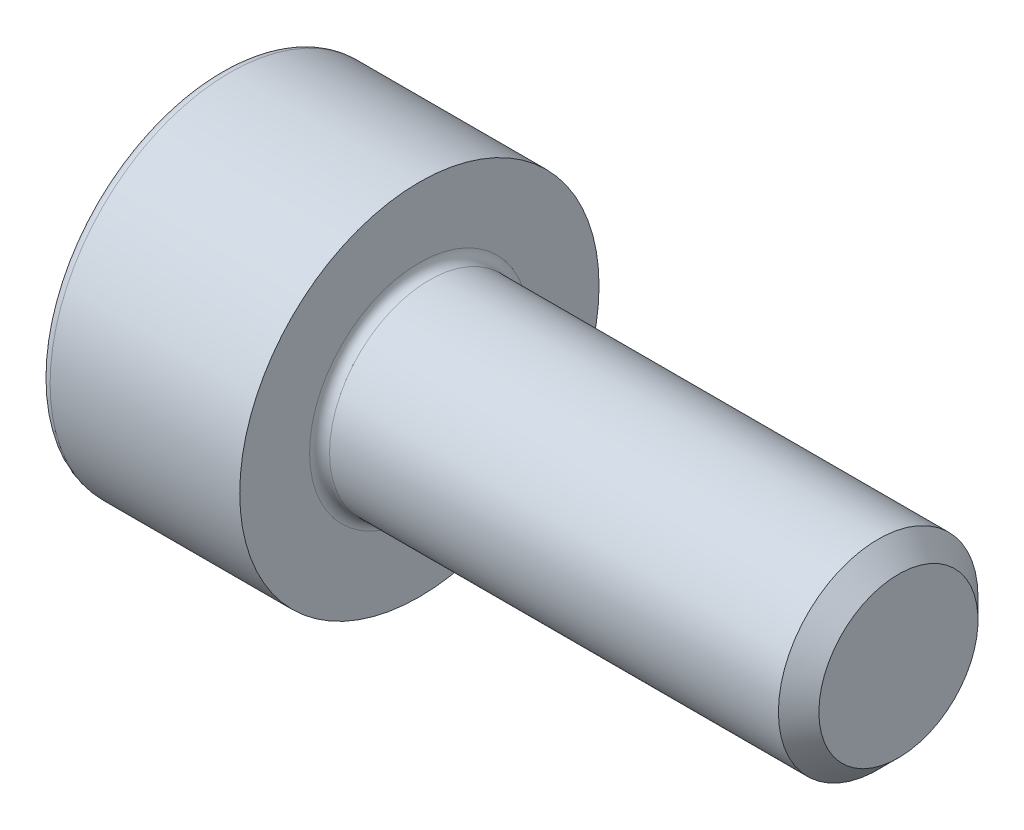
ISO-10303-21;
HEADER;
FILE_DESCRIPTION(('STEP AP214'),'2;1');
FILE_NAME('part.step','',(''),(''),'','','');
FILE_SCHEMA(('AUTOMOTIVE_DESIGN { 1 0 10303 214 1 1 1 1 }'));
ENDSEC;
DATA;
#1=APPLICATION_CONTEXT('core data for automotive mechanical design processes');
#2=APPLICATION_PROTOCOL_DEFINITION('international standard','automotive_design',2000,#1);
#3=PRODUCT_CONTEXT('',#1,'mechanical');
#4=PRODUCT('Part','Part','',(#3));
#5=PRODUCT_RELATED_PRODUCT_CATEGORY('part','',(#4));
#6=PRODUCT_DEFINITION_FORMATION('','',#4);
#7=PRODUCT_DEFINITION_CONTEXT('part definition',#1,'design');
#8=PRODUCT_DEFINITION('design','',#6,#7);
#9=PRODUCT_DEFINITION_SHAPE('','',#8);
#10=(LENGTH_UNIT() NAMED_UNIT(*) SI_UNIT(.MILLI.,.METRE.));
#11=(NAMED_UNIT(*) PLANE_ANGLE_UNIT() SI_UNIT($,.RADIAN.));
#12=(NAMED_UNIT(*) SI_UNIT($,.STERADIAN.) SOLID_ANGLE_UNIT());
#13=UNCERTAINTY_MEASURE_WITH_UNIT(LENGTH_MEASURE(1.E-05),#10,'distance_accuracy_value','');
#14=(GEOMETRIC_REPRESENTATION_CONTEXT(3) GLOBAL_UNCERTAINTY_ASSIGNED_CONTEXT((#13)) GLOBAL_UNIT_ASSIGNED_CONTEXT((#10,
#11,#12)) REPRESENTATION_CONTEXT('',''));
#15=CARTESIAN_POINT('',(0.,0.,0.));
#16=DIRECTION('',(0.,0.,1.));
#17=DIRECTION('',(1.,0.,0.));
#18=AXIS2_PLACEMENT_3D('',#15,#16,#17);
#19=CARTESIAN_POINT('',(6.,0.,0.));
#20=DIRECTION('',(-1.,0.,0.));
#21=DIRECTION('',(0.,0.,1.));
#22=AXIS2_PLACEMENT_3D('',#19,#20,#21);
#23=CONICAL_SURFACE('',#22,0.996499999993503,0.785398163397451);
#24=CARTESIAN_POINT('',(5.7464999999935,0.,0.));
#25=DIRECTION('',(-1.,0.,0.));
#26=DIRECTION('',(0.,0.,1.));
#27=AXIS2_PLACEMENT_3D('',#24,#25,#26);
#28=CIRCLE('',#27,1.25);
#29=CARTESIAN_POINT('',(5.7464999999935,0.,1.25));
#30=VERTEX_POINT('',#29);
#31=EDGE_CURVE('E11',#30,#30,#28,.T.);
#32=ORIENTED_EDGE('',*,*,#31,.F.);
#33=EDGE_LOOP('',(#32));
#34=FACE_BOUND('',#33,.T.);
#35=CARTESIAN_POINT('',(6.,0.,0.));
#36=DIRECTION('',(-1.,0.,0.));
#37=DIRECTION('',(0.,0.,1.));
#38=AXIS2_PLACEMENT_3D('',#35,#36,#37);
#39=CIRCLE('',#38,0.996499999993503);
#40=CARTESIAN_POINT('',(6.,0.,0.996499999993503));
#41=VERTEX_POINT('',#40);
#42=EDGE_CURVE('E133',#41,#41,#39,.T.);
#43=ORIENTED_EDGE('',*,*,#42,.T.);
#44=EDGE_LOOP('',(#43));
#45=FACE_BOUND('',#44,.T.);
#46=ADVANCED_FACE('F32',(#34,#45),#23,.T.);
#47=CARTESIAN_POINT('',(-2.5,0.,0.));
#48=DIRECTION('',(-1.,0.,0.));
#49=DIRECTION('',(0.,0.,1.));
#50=AXIS2_PLACEMENT_3D('',#47,#48,#49);
#51=CYLINDRICAL_SURFACE('',#50,1.25);
#52=CARTESIAN_POINT('',(0.125,0.,0.));
#53=DIRECTION('',(-1.,0.,0.));
#54=DIRECTION('',(0.,0.,1.));
#55=AXIS2_PLACEMENT_3D('',#52,#53,#54);
#56=CIRCLE('',#55,1.25);
#57=CARTESIAN_POINT('',(0.125,0.,1.25));
#58=VERTEX_POINT('',#57);
#59=EDGE_CURVE('E39',#58,#58,#56,.T.);
#60=ORIENTED_EDGE('',*,*,#59,.F.);
#61=EDGE_LOOP('',(#60));
#62=FACE_BOUND('',#61,.T.);
#63=ORIENTED_EDGE('',*,*,#31,.T.);
#64=EDGE_LOOP('',(#63));
#65=FACE_BOUND('',#64,.T.);
#66=ADVANCED_FACE('F157',(#62,#65),#51,.T.);
#67=CARTESIAN_POINT('',(0.125,0.,0.));
#68=DIRECTION('',(-1.,0.,0.));
#69=DIRECTION('',(0.,0.,1.));
#70=AXIS2_PLACEMENT_3D('',#67,#68,#69);
#71=TOROIDAL_SURFACE('',#70,1.375,0.125);
#72=CARTESIAN_POINT('',(0.,0.,0.));
#73=DIRECTION('',(-1.,0.,0.));
#74=DIRECTION('',(0.,0.,1.));
#75=AXIS2_PLACEMENT_3D('',#72,#73,#74);
#76=CIRCLE('',#75,1.375);
#77=CARTESIAN_POINT('',(0.,0.,1.375));
#78=VERTEX_POINT('',#77);
#79=EDGE_CURVE('E150',#78,#78,#76,.T.);
#80=ORIENTED_EDGE('',*,*,#79,.F.);
#81=EDGE_LOOP('',(#80));
#82=FACE_BOUND('',#81,.T.);
#83=ORIENTED_EDGE('',*,*,#59,.T.);
#84=EDGE_LOOP('',(#83));
#85=FACE_BOUND('',#84,.T.);
#86=ADVANCED_FACE('F155',(#82,#85),#71,.F.);
#87=CARTESIAN_POINT('',(0.,1.375,0.));
#88=DIRECTION('',(-1.,0.,0.));
#89=DIRECTION('',(0.,0.,1.));
#90=AXIS2_PLACEMENT_3D('',#87,#88,#89);
#91=PLANE('',#90);
#92=CARTESIAN_POINT('',(0.,0.,0.));
#93=DIRECTION('',(-1.,0.,0.));
#94=DIRECTION('',(0.,0.,1.));
#95=AXIS2_PLACEMENT_3D('',#92,#93,#94);
#96=CIRCLE('',#95,2.25);
#97=CARTESIAN_POINT('',(0.,0.,2.25));
#98=VERTEX_POINT('',#97);
#99=EDGE_CURVE('E147',#98,#98,#96,.T.);
#100=ORIENTED_EDGE('',*,*,#99,.F.);
#101=EDGE_LOOP('',(#100));
#102=FACE_BOUND('',#101,.T.);
#103=ORIENTED_EDGE('',*,*,#79,.T.);
#104=EDGE_LOOP('',(#103));
#105=FACE_BOUND('',#104,.T.);
#106=ADVANCED_FACE('F188',(#102,#105),#91,.F.);
#107=CARTESIAN_POINT('',(-2.5,0.,0.));
#108=DIRECTION('',(-1.,0.,0.));
#109=DIRECTION('',(0.,0.,1.));
#110=AXIS2_PLACEMENT_3D('',#107,#108,#109);
#111=CYLINDRICAL_SURFACE('',#110,2.25);
#112=CARTESIAN_POINT('',(-2.375,0.,0.));
#113=DIRECTION('',(-1.,0.,0.));
#114=DIRECTION('',(0.,0.,1.));
#115=AXIS2_PLACEMENT_3D('',#112,#113,#114);
#116=CIRCLE('',#115,2.25);
#117=CARTESIAN_POINT('',(-2.375,0.,2.25));
#118=VERTEX_POINT('',#117);
#119=EDGE_CURVE('E144',#118,#118,#116,.T.);
#120=ORIENTED_EDGE('',*,*,#119,.F.);
#121=EDGE_LOOP('',(#120));
#122=FACE_BOUND('',#121,.T.);
#123=ORIENTED_EDGE('',*,*,#99,.T.);
#124=EDGE_LOOP('',(#123));
#125=FACE_BOUND('',#124,.T.);
#126=ADVANCED_FACE('F184',(#122,#125),#111,.T.);
#127=CARTESIAN_POINT('',(-2.375,0.,0.));
#128=DIRECTION('',(-1.,0.,0.));
#129=DIRECTION('',(0.,0.,1.));
#130=AXIS2_PLACEMENT_3D('',#127,#128,#129);
#131=TOROIDAL_SURFACE('',#130,2.125,0.125);
#132=CARTESIAN_POINT('',(-2.5,0.,0.));
#133=DIRECTION('',(-1.,0.,0.));
#134=DIRECTION('',(0.,0.,1.));
#135=AXIS2_PLACEMENT_3D('',#132,#133,#134);
#136=CIRCLE('',#135,2.125);
#137=CARTESIAN_POINT('',(-2.5,0.,2.125));
#138=VERTEX_POINT('',#137);
#139=EDGE_CURVE('E141',#138,#138,#136,.T.);
#140=ORIENTED_EDGE('',*,*,#139,.F.);
#141=EDGE_LOOP('',(#140));
#142=FACE_BOUND('',#141,.T.);
#143=ORIENTED_EDGE('',*,*,#119,.T.);
#144=EDGE_LOOP('',(#143));
#145=FACE_BOUND('',#144,.T.);
#146=ADVANCED_FACE('F177',(#142,#145),#131,.T.);
#147=CARTESIAN_POINT('',(-2.5,2.125,0.));
#148=DIRECTION('',(1.,0.,0.));
#149=DIRECTION('',(0.,0.,-1.));
#150=AXIS2_PLACEMENT_3D('',#147,#148,#149);
#151=PLANE('',#150);
#152=DIRECTION('',(0.,0.5,-0.866025403784438));
#153=VECTOR('',#152,1.);
#154=CARTESIAN_POINT('',(-2.5,0.591784025919366,1.025));
#155=LINE('',#154,#153);
#156=CARTESIAN_POINT('',(-2.5,0.591784025919366,1.025));
#157=VERTEX_POINT('',#156);
#158=CARTESIAN_POINT('',(-2.5,1.18356805183873,0.));
#159=VERTEX_POINT('',#158);
#160=EDGE_CURVE('E120',#157,#159,#155,.T.);
#161=ORIENTED_EDGE('',*,*,#160,.F.);
#162=DIRECTION('',(0.,1.,0.));
#163=VECTOR('',#162,1.);
#164=CARTESIAN_POINT('',(-2.5,-0.591784025919367,1.025));
#165=LINE('',#164,#163);
#166=CARTESIAN_POINT('',(-2.5,-0.591784025919367,1.025));
#167=VERTEX_POINT('',#166);
#168=EDGE_CURVE('E46',#167,#157,#165,.T.);
#169=ORIENTED_EDGE('',*,*,#168,.F.);
#170=DIRECTION('',(0.,0.5,0.866025403784439));
#171=VECTOR('',#170,1.);
#172=CARTESIAN_POINT('',(-2.5,-1.18356805183873,0.));
#173=LINE('',#172,#171);
#174=CARTESIAN_POINT('',(-2.5,-1.18356805183873,0.));
#175=VERTEX_POINT('',#174);
#176=EDGE_CURVE('E129',#175,#167,#173,.T.);
#177=ORIENTED_EDGE('',*,*,#176,.F.);
#178=DIRECTION('',(0.,-0.5,0.866025403784438));
#179=VECTOR('',#178,1.);
#180=CARTESIAN_POINT('',(-2.5,-0.591784025919366,-1.025));
#181=LINE('',#180,#179);
#182=CARTESIAN_POINT('',(-2.5,-0.591784025919366,-1.025));
#183=VERTEX_POINT('',#182);
#184=EDGE_CURVE('E127',#183,#175,#181,.T.);
#185=ORIENTED_EDGE('',*,*,#184,.F.);
#186=DIRECTION('',(0.,-1.,0.));
#187=VECTOR('',#186,1.);
#188=CARTESIAN_POINT('',(-2.5,0.591784025919367,-1.025));
#189=LINE('',#188,#187);
#190=CARTESIAN_POINT('',(-2.5,0.591784025919367,-1.025));
#191=VERTEX_POINT('',#190);
#192=EDGE_CURVE('E94',#191,#183,#189,.T.);
#193=ORIENTED_EDGE('',*,*,#192,.F.);
#194=DIRECTION('',(0.,-0.5,-0.866025403784439));
#195=VECTOR('',#194,1.);
#196=CARTESIAN_POINT('',(-2.5,1.18356805183873,0.));
#197=LINE('',#196,#195);
#198=EDGE_CURVE('E123',#159,#191,#197,.T.);
#199=ORIENTED_EDGE('',*,*,#198,.F.);
#200=EDGE_LOOP('',(#161,#169,#177,#185,#193,#199));
#201=FACE_BOUND('',#200,.T.);
#202=ORIENTED_EDGE('',*,*,#139,.T.);
#203=EDGE_LOOP('',(#202));
#204=FACE_BOUND('',#203,.T.);
#205=ADVANCED_FACE('F169',(#201,#204),#151,.F.);
#206=CARTESIAN_POINT('',(6.,0.996499999993503,0.));
#207=DIRECTION('',(-1.,0.,0.));
#208=DIRECTION('',(0.,0.,1.));
#209=AXIS2_PLACEMENT_3D('',#206,#207,#208);
#210=PLANE('',#209);
#211=ORIENTED_EDGE('',*,*,#42,.F.);
#212=EDGE_LOOP('',(#211));
#213=FACE_BOUND('',#212,.T.);
#214=ADVANCED_FACE('F166',(#213),#210,.F.);
#215=CARTESIAN_POINT('',(-1.4,-0.591784025919367,1.025));
#216=DIRECTION('',(0.,0.,1.));
#217=DIRECTION('',(1.,0.,0.));
#218=AXIS2_PLACEMENT_3D('',#215,#216,#217);
#219=PLANE('',#218);
#220=ORIENTED_EDGE('',*,*,#168,.T.);
#221=DIRECTION('',(-1.,0.,0.));
#222=VECTOR('',#221,1.);
#223=CARTESIAN_POINT('',(-1.4,0.591784025919366,1.025));
#224=LINE('',#223,#222);
#225=CARTESIAN_POINT('',(-1.4,0.591784025919366,1.025));
#226=VERTEX_POINT('',#225);
#227=EDGE_CURVE('E76',#226,#157,#224,.T.);
#228=ORIENTED_EDGE('',*,*,#227,.F.);
#229=DIRECTION('',(0.,1.,0.));
#230=VECTOR('',#229,1.);
#231=CARTESIAN_POINT('',(-1.4,-0.591784025919367,1.025));
#232=LINE('',#231,#230);
#233=CARTESIAN_POINT('',(-1.4,-0.591784025919367,1.025));
#234=VERTEX_POINT('',#233);
#235=EDGE_CURVE('E131',#234,#226,#232,.T.);
#236=ORIENTED_EDGE('',*,*,#235,.F.);
#237=DIRECTION('',(-1.,0.,0.));
#238=VECTOR('',#237,1.);
#239=CARTESIAN_POINT('',(-1.4,-0.591784025919367,1.025));
#240=LINE('',#239,#238);
#241=EDGE_CURVE('E54',#234,#167,#240,.T.);
#242=ORIENTED_EDGE('',*,*,#241,.T.);
#243=EDGE_LOOP('',(#220,#228,#236,#242));
#244=FACE_BOUND('',#243,.T.);
#245=ADVANCED_FACE('F168',(#244),#219,.F.);
#246=CARTESIAN_POINT('',(-1.4,-1.18356805183873,0.));
#247=DIRECTION('',(0.,-0.866025403784439,0.5));
#248=DIRECTION('',(0.,-0.5,-0.866025403784439));
#249=AXIS2_PLACEMENT_3D('',#246,#247,#248);
#250=PLANE('',#249);
#251=ORIENTED_EDGE('',*,*,#176,.T.);
#252=ORIENTED_EDGE('',*,*,#241,.F.);
#253=DIRECTION('',(0.,0.5,0.866025403784439));
#254=VECTOR('',#253,1.);
#255=CARTESIAN_POINT('',(-1.4,-1.18356805183873,0.));
#256=LINE('',#255,#254);
#257=CARTESIAN_POINT('',(-1.4,-1.18356805183873,0.));
#258=VERTEX_POINT('',#257);
#259=EDGE_CURVE('E106',#258,#234,#256,.T.);
#260=ORIENTED_EDGE('',*,*,#259,.F.);
#261=DIRECTION('',(-1.,0.,0.));
#262=VECTOR('',#261,1.);
#263=CARTESIAN_POINT('',(-1.4,-1.18356805183873,0.));
#264=LINE('',#263,#262);
#265=EDGE_CURVE('E98',#258,#175,#264,.T.);
#266=ORIENTED_EDGE('',*,*,#265,.T.);
#267=EDGE_LOOP('',(#251,#252,#260,#266));
#268=FACE_BOUND('',#267,.T.);
#269=ADVANCED_FACE('F175',(#268),#250,.F.);
#270=CARTESIAN_POINT('',(-1.4,-0.591784025919366,-1.025));
#271=DIRECTION('',(0.,-0.866025403784439,-0.5));
#272=DIRECTION('',(0.,0.5,-0.866025403784438));
#273=AXIS2_PLACEMENT_3D('',#270,#271,#272);
#274=PLANE('',#273);
#275=ORIENTED_EDGE('',*,*,#184,.T.);
#276=ORIENTED_EDGE('',*,*,#265,.F.);
#277=DIRECTION('',(0.,-0.5,0.866025403784438));
#278=VECTOR('',#277,1.);
#279=CARTESIAN_POINT('',(-1.4,-0.591784025919366,-1.025));
#280=LINE('',#279,#278);
#281=CARTESIAN_POINT('',(-1.4,-0.591784025919366,-1.025));
#282=VERTEX_POINT('',#281);
#283=EDGE_CURVE('E102',#282,#258,#280,.T.);
#284=ORIENTED_EDGE('',*,*,#283,.F.);
#285=DIRECTION('',(-1.,0.,0.));
#286=VECTOR('',#285,1.);
#287=CARTESIAN_POINT('',(-1.4,-0.591784025919366,-1.025));
#288=LINE('',#287,#286);
#289=EDGE_CURVE('E87',#282,#183,#288,.T.);
#290=ORIENTED_EDGE('',*,*,#289,.T.);
#291=EDGE_LOOP('',(#275,#276,#284,#290));
#292=FACE_BOUND('',#291,.T.);
#293=ADVANCED_FACE('F103',(#292),#274,.F.);
#294=CARTESIAN_POINT('',(-1.4,0.591784025919367,-1.025));
#295=DIRECTION('',(0.,0.,-1.));
#296=DIRECTION('',(-1.,0.,0.));
#297=AXIS2_PLACEMENT_3D('',#294,#295,#296);
#298=PLANE('',#297);
#299=ORIENTED_EDGE('',*,*,#192,.T.);
#300=ORIENTED_EDGE('',*,*,#289,.F.);
#301=DIRECTION('',(0.,-1.,0.));
#302=VECTOR('',#301,1.);
#303=CARTESIAN_POINT('',(-1.4,0.591784025919367,-1.025));
#304=LINE('',#303,#302);
#305=CARTESIAN_POINT('',(-1.4,0.591784025919367,-1.025));
#306=VERTEX_POINT('',#305);
#307=EDGE_CURVE('E91',#306,#282,#304,.T.);
#308=ORIENTED_EDGE('',*,*,#307,.F.);
#309=DIRECTION('',(-1.,0.,0.));
#310=VECTOR('',#309,1.);
#311=CARTESIAN_POINT('',(-1.4,0.591784025919367,-1.025));
#312=LINE('',#311,#310);
#313=EDGE_CURVE('E99',#306,#191,#312,.T.);
#314=ORIENTED_EDGE('',*,*,#313,.T.);
#315=EDGE_LOOP('',(#299,#300,#308,#314));
#316=FACE_BOUND('',#315,.T.);
#317=ADVANCED_FACE('F89',(#316),#298,.F.);
#318=CARTESIAN_POINT('',(-1.4,1.18356805183873,0.));
#319=DIRECTION('',(0.,0.866025403784439,-0.5));
#320=DIRECTION('',(0.,0.5,0.866025403784439));
#321=AXIS2_PLACEMENT_3D('',#318,#319,#320);
#322=PLANE('',#321);
#323=ORIENTED_EDGE('',*,*,#198,.T.);
#324=ORIENTED_EDGE('',*,*,#313,.F.);
#325=DIRECTION('',(0.,-0.5,-0.866025403784439));
#326=VECTOR('',#325,1.);
#327=CARTESIAN_POINT('',(-1.4,1.18356805183873,0.));
#328=LINE('',#327,#326);
#329=CARTESIAN_POINT('',(-1.4,1.18356805183873,0.));
#330=VERTEX_POINT('',#329);
#331=EDGE_CURVE('E112',#330,#306,#328,.T.);
#332=ORIENTED_EDGE('',*,*,#331,.F.);
#333=DIRECTION('',(-1.,0.,0.));
#334=VECTOR('',#333,1.);
#335=CARTESIAN_POINT('',(-1.4,1.18356805183873,0.));
#336=LINE('',#335,#334);
#337=EDGE_CURVE('E136',#330,#159,#336,.T.);
#338=ORIENTED_EDGE('',*,*,#337,.T.);
#339=EDGE_LOOP('',(#323,#324,#332,#338));
#340=FACE_BOUND('',#339,.T.);
#341=ADVANCED_FACE('F250',(#340),#322,.F.);
#342=CARTESIAN_POINT('',(-1.4,0.591784025919366,1.025));
#343=DIRECTION('',(0.,0.866025403784439,0.5));
#344=DIRECTION('',(0.,-0.5,0.866025403784438));
#345=AXIS2_PLACEMENT_3D('',#342,#343,#344);
#346=PLANE('',#345);
#347=ORIENTED_EDGE('',*,*,#160,.T.);
#348=ORIENTED_EDGE('',*,*,#337,.F.);
#349=DIRECTION('',(0.,0.5,-0.866025403784438));
#350=VECTOR('',#349,1.);
#351=CARTESIAN_POINT('',(-1.4,0.591784025919366,1.025));
#352=LINE('',#351,#350);
#353=EDGE_CURVE('E114',#226,#330,#352,.T.);
#354=ORIENTED_EDGE('',*,*,#353,.F.);
#355=ORIENTED_EDGE('',*,*,#227,.T.);
#356=EDGE_LOOP('',(#347,#348,#354,#355));
#357=FACE_BOUND('',#356,.T.);
#358=ADVANCED_FACE('F259',(#357),#346,.F.);
#359=CARTESIAN_POINT('',(-1.4,0.,0.));
#360=DIRECTION('',(-1.,0.,0.));
#361=DIRECTION('',(0.,0.,1.));
#362=AXIS2_PLACEMENT_3D('',#359,#360,#361);
#363=PLANE('',#362);
#364=ORIENTED_EDGE('',*,*,#235,.T.);
#365=ORIENTED_EDGE('',*,*,#353,.T.);
#366=ORIENTED_EDGE('',*,*,#331,.T.);
#367=ORIENTED_EDGE('',*,*,#307,.T.);
#368=ORIENTED_EDGE('',*,*,#283,.T.);
#369=ORIENTED_EDGE('',*,*,#259,.T.);
#370=EDGE_LOOP('',(#364,#365,#366,#367,#368,#369));
#371=FACE_BOUND('',#370,.T.);
#372=ADVANCED_FACE('F109',(#371),#363,.T.);
#373=CLOSED_SHELL('',(#46,#66,#86,#106,#126,#146,#205,#214,#245,#269,#293,#317,#341,#358,#372));
#374=MANIFOLD_SOLID_BREP('B2',#373);
#375=ADVANCED_BREP_SHAPE_REPRESENTATION('',(#18,#374),#14);
#376=SHAPE_DEFINITION_REPRESENTATION(#9,#375);
ENDSEC;
END-ISO-10303-21;
